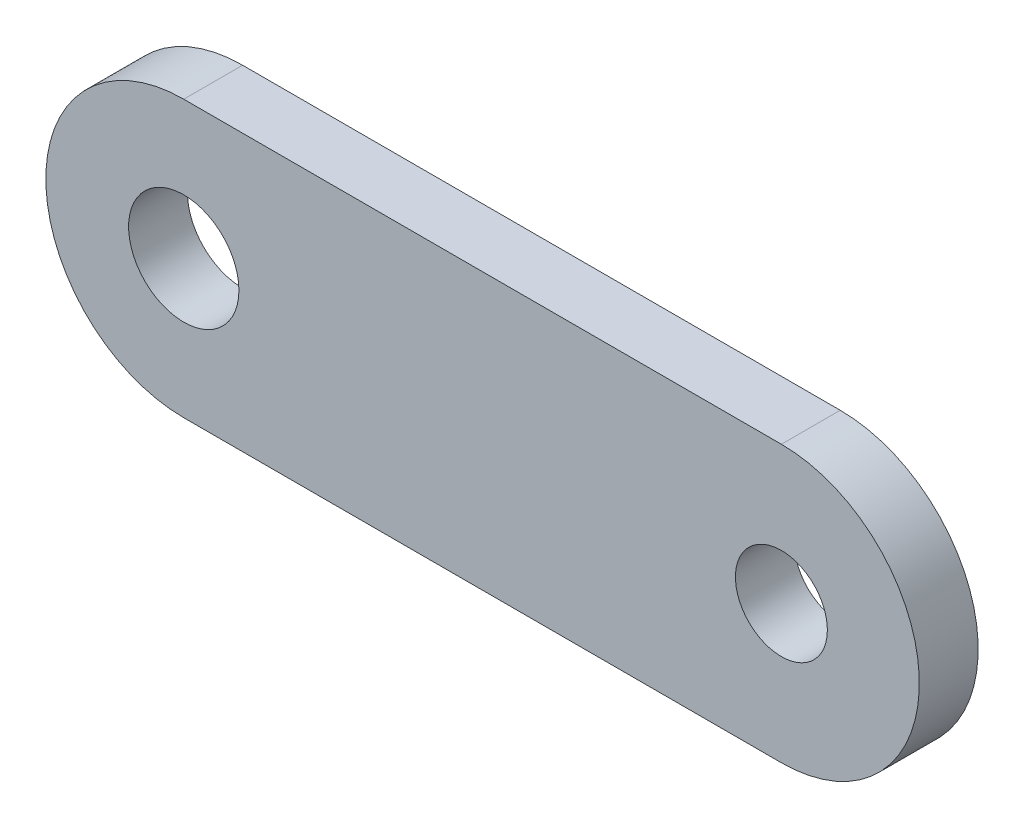
ISO-10303-21;
HEADER;
FILE_DESCRIPTION(('STEP AP214'),'2;1');
FILE_NAME('part.step','',(''),(''),'','','');
FILE_SCHEMA(('AUTOMOTIVE_DESIGN { 1 0 10303 214 1 1 1 1 }'));
ENDSEC;
DATA;
#1=APPLICATION_CONTEXT('core data for automotive mechanical design processes');
#2=APPLICATION_PROTOCOL_DEFINITION('international standard','automotive_design',2000,#1);
#3=PRODUCT_CONTEXT('',#1,'mechanical');
#4=PRODUCT('Part','Part','',(#3));
#5=PRODUCT_RELATED_PRODUCT_CATEGORY('part','',(#4));
#6=PRODUCT_DEFINITION_FORMATION('','',#4);
#7=PRODUCT_DEFINITION_CONTEXT('part definition',#1,'design');
#8=PRODUCT_DEFINITION('design','',#6,#7);
#9=PRODUCT_DEFINITION_SHAPE('','',#8);
#10=(LENGTH_UNIT() NAMED_UNIT(*) SI_UNIT(.MILLI.,.METRE.));
#11=(NAMED_UNIT(*) PLANE_ANGLE_UNIT() SI_UNIT($,.RADIAN.));
#12=(NAMED_UNIT(*) SI_UNIT($,.STERADIAN.) SOLID_ANGLE_UNIT());
#13=UNCERTAINTY_MEASURE_WITH_UNIT(LENGTH_MEASURE(1.E-05),#10,'distance_accuracy_value','');
#14=(GEOMETRIC_REPRESENTATION_CONTEXT(3) GLOBAL_UNCERTAINTY_ASSIGNED_CONTEXT((#13)) GLOBAL_UNIT_ASSIGNED_CONTEXT((#10,
#11,#12)) REPRESENTATION_CONTEXT('',''));
#15=CARTESIAN_POINT('',(0.,0.,0.));
#16=DIRECTION('',(0.,0.,1.));
#17=DIRECTION('',(1.,0.,0.));
#18=AXIS2_PLACEMENT_3D('',#15,#16,#17);
#19=CARTESIAN_POINT('',(-71.7399998979994,-3.8872261890847E-13,1.016));
#20=DIRECTION('',(0.,0.,1.));
#21=DIRECTION('',(1.,0.,0.));
#22=AXIS2_PLACEMENT_3D('',#19,#20,#21);
#23=PLANE('',#22);
#24=CARTESIAN_POINT('',(-71.7399998979994,-3.8872261890847E-13,1.016));
#25=DIRECTION('',(0.,0.,1.));
#26=DIRECTION('',(1.,0.,0.));
#27=AXIS2_PLACEMENT_3D('',#24,#25,#26);
#28=CIRCLE('',#27,1.58750000000032);
#29=CARTESIAN_POINT('',(-70.152499897999,-3.8872261890847E-13,1.016));
#30=VERTEX_POINT('',#29);
#31=EDGE_CURVE('E97',#30,#30,#28,.T.);
#32=ORIENTED_EDGE('',*,*,#31,.F.);
#33=EDGE_LOOP('',(#32));
#34=FACE_BOUND('',#33,.T.);
#35=CARTESIAN_POINT('',(-71.7399998979994,-3.8872261890847E-13,1.016));
#36=DIRECTION('',(0.,0.,1.));
#37=DIRECTION('',(1.,0.,0.));
#38=AXIS2_PLACEMENT_3D('',#35,#36,#37);
#39=CIRCLE('',#38,4.7625);
#40=CARTESIAN_POINT('',(-71.7399998979994,-4.7625000000006,1.016));
#41=VERTEX_POINT('',#40);
#42=CARTESIAN_POINT('',(-71.7399998979994,4.7624999999994,1.016));
#43=VERTEX_POINT('',#42);
#44=EDGE_CURVE('E82',#41,#43,#39,.T.);
#45=ORIENTED_EDGE('',*,*,#44,.T.);
#46=DIRECTION('',(-1.,0.,0.));
#47=VECTOR('',#46,1.);
#48=CARTESIAN_POINT('',(-92.3749998979948,4.7624999999994,1.016));
#49=LINE('',#48,#47);
#50=CARTESIAN_POINT('',(-92.3749998979948,4.76249999999961,1.016));
#51=VERTEX_POINT('',#50);
#52=EDGE_CURVE('E77',#43,#51,#49,.T.);
#53=ORIENTED_EDGE('',*,*,#52,.T.);
#54=CARTESIAN_POINT('',(-92.3749998979948,-3.8872261890847E-13,1.016));
#55=DIRECTION('',(0.,0.,1.));
#56=DIRECTION('',(1.,0.,0.));
#57=AXIS2_PLACEMENT_3D('',#54,#55,#56);
#58=CIRCLE('',#57,4.7625);
#59=CARTESIAN_POINT('',(-92.3749998979948,-4.7625000000006,1.016));
#60=VERTEX_POINT('',#59);
#61=EDGE_CURVE('E80',#51,#60,#58,.T.);
#62=ORIENTED_EDGE('',*,*,#61,.T.);
#63=DIRECTION('',(1.,0.,0.));
#64=VECTOR('',#63,1.);
#65=CARTESIAN_POINT('',(-71.7399998979994,-4.7625000000006,1.016));
#66=LINE('',#65,#64);
#67=EDGE_CURVE('E47',#60,#41,#66,.T.);
#68=ORIENTED_EDGE('',*,*,#67,.T.);
#69=EDGE_LOOP('',(#45,#53,#62,#68));
#70=FACE_BOUND('',#69,.T.);
#71=CARTESIAN_POINT('',(-92.3749998979948,-3.8872261890847E-13,1.016));
#72=DIRECTION('',(0.,0.,1.));
#73=DIRECTION('',(1.,0.,0.));
#74=AXIS2_PLACEMENT_3D('',#71,#72,#73);
#75=CIRCLE('',#74,1.90500000000001);
#76=CARTESIAN_POINT('',(-90.4699998979948,-3.8872261890847E-13,1.016));
#77=VERTEX_POINT('',#76);
#78=EDGE_CURVE('E112',#77,#77,#75,.T.);
#79=ORIENTED_EDGE('',*,*,#78,.F.);
#80=EDGE_LOOP('',(#79));
#81=FACE_BOUND('',#80,.T.);
#82=ADVANCED_FACE('F30',(#34,#70,#81),#23,.T.);
#83=CARTESIAN_POINT('',(-71.7399998979994,-3.8872261890847E-13,-1.016));
#84=DIRECTION('',(0.,0.,1.));
#85=DIRECTION('',(1.,0.,0.));
#86=AXIS2_PLACEMENT_3D('',#83,#84,#85);
#87=PLANE('',#86);
#88=CARTESIAN_POINT('',(-71.7399998979994,-3.8872261890847E-13,-1.016));
#89=DIRECTION('',(0.,0.,1.));
#90=DIRECTION('',(1.,0.,0.));
#91=AXIS2_PLACEMENT_3D('',#88,#89,#90);
#92=CIRCLE('',#91,4.7625);
#93=CARTESIAN_POINT('',(-71.7399998979994,-4.7625000000006,-1.016));
#94=VERTEX_POINT('',#93);
#95=CARTESIAN_POINT('',(-71.7399998979994,4.7624999999994,-1.016));
#96=VERTEX_POINT('',#95);
#97=EDGE_CURVE('E94',#94,#96,#92,.T.);
#98=ORIENTED_EDGE('',*,*,#97,.F.);
#99=DIRECTION('',(1.,0.,0.));
#100=VECTOR('',#99,1.);
#101=CARTESIAN_POINT('',(-71.7399998979994,-4.7625000000006,-1.016));
#102=LINE('',#101,#100);
#103=CARTESIAN_POINT('',(-92.3749998979948,-4.7625000000006,-1.016));
#104=VERTEX_POINT('',#103);
#105=EDGE_CURVE('E70',#104,#94,#102,.T.);
#106=ORIENTED_EDGE('',*,*,#105,.F.);
#107=CARTESIAN_POINT('',(-92.3749998979948,-3.8872261890847E-13,-1.016));
#108=DIRECTION('',(0.,0.,1.));
#109=DIRECTION('',(1.,0.,0.));
#110=AXIS2_PLACEMENT_3D('',#107,#108,#109);
#111=CIRCLE('',#110,4.7625);
#112=CARTESIAN_POINT('',(-92.3749998979948,4.76249999999961,-1.016));
#113=VERTEX_POINT('',#112);
#114=EDGE_CURVE('E64',#113,#104,#111,.T.);
#115=ORIENTED_EDGE('',*,*,#114,.F.);
#116=DIRECTION('',(-1.,0.,0.));
#117=VECTOR('',#116,1.);
#118=CARTESIAN_POINT('',(-92.3749998979948,4.7624999999994,-1.016));
#119=LINE('',#118,#117);
#120=EDGE_CURVE('E86',#96,#113,#119,.T.);
#121=ORIENTED_EDGE('',*,*,#120,.F.);
#122=EDGE_LOOP('',(#98,#106,#115,#121));
#123=FACE_BOUND('',#122,.T.);
#124=CARTESIAN_POINT('',(-71.7399998979994,-3.8872261890847E-13,-1.016));
#125=DIRECTION('',(0.,0.,1.));
#126=DIRECTION('',(1.,0.,0.));
#127=AXIS2_PLACEMENT_3D('',#124,#125,#126);
#128=CIRCLE('',#127,1.58750000000032);
#129=CARTESIAN_POINT('',(-70.152499897999,-3.8872261890847E-13,-1.016));
#130=VERTEX_POINT('',#129);
#131=EDGE_CURVE('E109',#130,#130,#128,.T.);
#132=ORIENTED_EDGE('',*,*,#131,.T.);
#133=EDGE_LOOP('',(#132));
#134=FACE_BOUND('',#133,.T.);
#135=CARTESIAN_POINT('',(-92.3749998979948,-3.8872261890847E-13,-1.016));
#136=DIRECTION('',(0.,0.,1.));
#137=DIRECTION('',(1.,0.,0.));
#138=AXIS2_PLACEMENT_3D('',#135,#136,#137);
#139=CIRCLE('',#138,1.90500000000001);
#140=CARTESIAN_POINT('',(-90.4699998979948,-3.8872261890847E-13,-1.016));
#141=VERTEX_POINT('',#140);
#142=EDGE_CURVE('E115',#141,#141,#139,.T.);
#143=ORIENTED_EDGE('',*,*,#142,.T.);
#144=EDGE_LOOP('',(#143));
#145=FACE_BOUND('',#144,.T.);
#146=ADVANCED_FACE('F105',(#123,#134,#145),#87,.F.);
#147=CARTESIAN_POINT('',(-71.7399998979994,-3.8872261890847E-13,1.016));
#148=DIRECTION('',(0.,0.,-1.));
#149=DIRECTION('',(-1.,0.,0.));
#150=AXIS2_PLACEMENT_3D('',#147,#148,#149);
#151=CYLINDRICAL_SURFACE('',#150,4.7625);
#152=ORIENTED_EDGE('',*,*,#97,.T.);
#153=DIRECTION('',(0.,0.,-1.));
#154=VECTOR('',#153,1.);
#155=CARTESIAN_POINT('',(-71.7399998979994,4.7624999999994,1.016));
#156=LINE('',#155,#154);
#157=EDGE_CURVE('E11',#43,#96,#156,.T.);
#158=ORIENTED_EDGE('',*,*,#157,.F.);
#159=ORIENTED_EDGE('',*,*,#44,.F.);
#160=DIRECTION('',(0.,0.,-1.));
#161=VECTOR('',#160,1.);
#162=CARTESIAN_POINT('',(-71.7399998979994,-4.7625000000006,1.016));
#163=LINE('',#162,#161);
#164=EDGE_CURVE('E90',#41,#94,#163,.T.);
#165=ORIENTED_EDGE('',*,*,#164,.T.);
#166=EDGE_LOOP('',(#152,#158,#159,#165));
#167=FACE_BOUND('',#166,.T.);
#168=ADVANCED_FACE('F32',(#167),#151,.T.);
#169=CARTESIAN_POINT('',(-92.3749998979948,4.7624999999994,1.016));
#170=DIRECTION('',(0.,-1.,0.));
#171=DIRECTION('',(1.,0.,0.));
#172=AXIS2_PLACEMENT_3D('',#169,#170,#171);
#173=PLANE('',#172);
#174=ORIENTED_EDGE('',*,*,#120,.T.);
#175=DIRECTION('',(0.,0.,-1.));
#176=VECTOR('',#175,1.);
#177=CARTESIAN_POINT('',(-92.3749998979948,4.76249999999961,1.016));
#178=LINE('',#177,#176);
#179=EDGE_CURVE('E39',#51,#113,#178,.T.);
#180=ORIENTED_EDGE('',*,*,#179,.F.);
#181=ORIENTED_EDGE('',*,*,#52,.F.);
#182=ORIENTED_EDGE('',*,*,#157,.T.);
#183=EDGE_LOOP('',(#174,#180,#181,#182));
#184=FACE_BOUND('',#183,.T.);
#185=ADVANCED_FACE('F85',(#184),#173,.F.);
#186=CARTESIAN_POINT('',(-92.3749998979948,-3.8872261890847E-13,1.016));
#187=DIRECTION('',(0.,0.,-1.));
#188=DIRECTION('',(-1.,0.,0.));
#189=AXIS2_PLACEMENT_3D('',#186,#187,#188);
#190=CYLINDRICAL_SURFACE('',#189,4.7625);
#191=ORIENTED_EDGE('',*,*,#114,.T.);
#192=DIRECTION('',(0.,0.,-1.));
#193=VECTOR('',#192,1.);
#194=CARTESIAN_POINT('',(-92.3749998979948,-4.7625000000006,1.016));
#195=LINE('',#194,#193);
#196=EDGE_CURVE('E87',#60,#104,#195,.T.);
#197=ORIENTED_EDGE('',*,*,#196,.F.);
#198=ORIENTED_EDGE('',*,*,#61,.F.);
#199=ORIENTED_EDGE('',*,*,#179,.T.);
#200=EDGE_LOOP('',(#191,#197,#198,#199));
#201=FACE_BOUND('',#200,.T.);
#202=ADVANCED_FACE('F88',(#201),#190,.T.);
#203=CARTESIAN_POINT('',(-71.7399998979994,-4.7625000000006,1.016));
#204=DIRECTION('',(0.,1.,0.));
#205=DIRECTION('',(-1.,0.,0.));
#206=AXIS2_PLACEMENT_3D('',#203,#204,#205);
#207=PLANE('',#206);
#208=ORIENTED_EDGE('',*,*,#105,.T.);
#209=ORIENTED_EDGE('',*,*,#164,.F.);
#210=ORIENTED_EDGE('',*,*,#67,.F.);
#211=ORIENTED_EDGE('',*,*,#196,.T.);
#212=EDGE_LOOP('',(#208,#209,#210,#211));
#213=FACE_BOUND('',#212,.T.);
#214=ADVANCED_FACE('F102',(#213),#207,.F.);
#215=CARTESIAN_POINT('',(-71.7399998979994,-3.8872261890847E-13,1.016));
#216=DIRECTION('',(0.,0.,-1.));
#217=DIRECTION('',(-1.,0.,0.));
#218=AXIS2_PLACEMENT_3D('',#215,#216,#217);
#219=CYLINDRICAL_SURFACE('',#218,1.58750000000032);
#220=ORIENTED_EDGE('',*,*,#31,.T.);
#221=EDGE_LOOP('',(#220));
#222=FACE_BOUND('',#221,.T.);
#223=ORIENTED_EDGE('',*,*,#131,.F.);
#224=EDGE_LOOP('',(#223));
#225=FACE_BOUND('',#224,.T.);
#226=ADVANCED_FACE('F132',(#222,#225),#219,.F.);
#227=CARTESIAN_POINT('',(-92.3749998979948,-3.8872261890847E-13,1.016));
#228=DIRECTION('',(0.,0.,-1.));
#229=DIRECTION('',(-1.,0.,0.));
#230=AXIS2_PLACEMENT_3D('',#227,#228,#229);
#231=CYLINDRICAL_SURFACE('',#230,1.90500000000001);
#232=ORIENTED_EDGE('',*,*,#78,.T.);
#233=EDGE_LOOP('',(#232));
#234=FACE_BOUND('',#233,.T.);
#235=ORIENTED_EDGE('',*,*,#142,.F.);
#236=EDGE_LOOP('',(#235));
#237=FACE_BOUND('',#236,.T.);
#238=ADVANCED_FACE('F121',(#234,#237),#231,.F.);
#239=CLOSED_SHELL('',(#82,#146,#168,#185,#202,#214,#226,#238));
#240=MANIFOLD_SOLID_BREP('B2',#239);
#241=ADVANCED_BREP_SHAPE_REPRESENTATION('',(#18,#240),#14);
#242=SHAPE_DEFINITION_REPRESENTATION(#9,#241);
ENDSEC;
END-ISO-10303-21;
